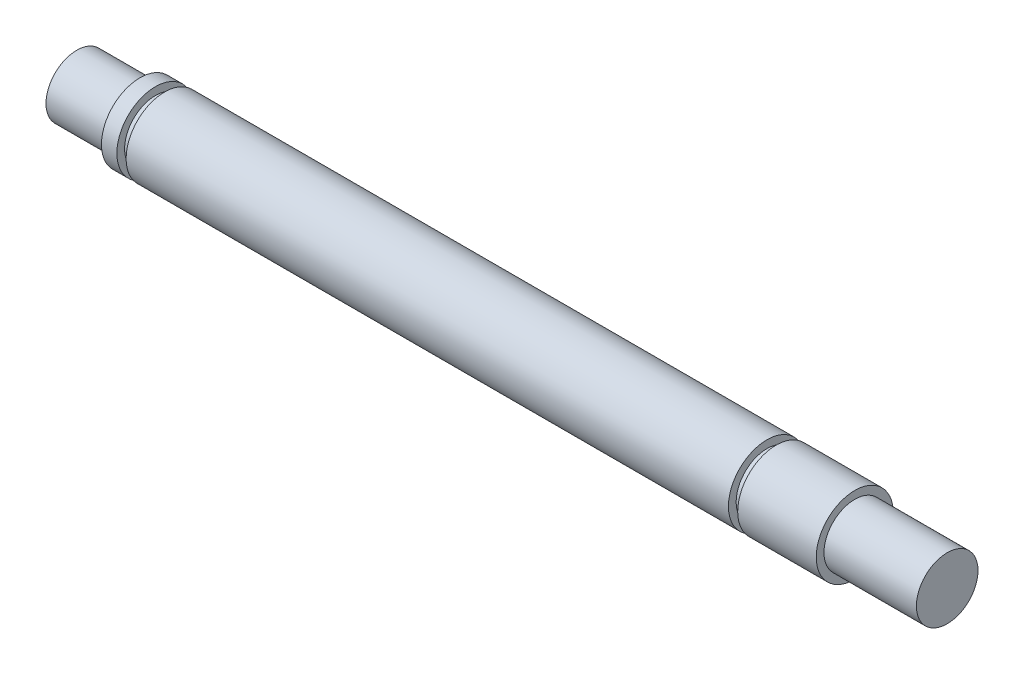
ISO-10303-21;
HEADER;
FILE_DESCRIPTION(('STEP AP214'),'2;1');
FILE_NAME('part.step','',(''),(''),'','','');
FILE_SCHEMA(('AUTOMOTIVE_DESIGN { 1 0 10303 214 1 1 1 1 }'));
ENDSEC;
DATA;
#1=APPLICATION_CONTEXT('core data for automotive mechanical design processes');
#2=APPLICATION_PROTOCOL_DEFINITION('international standard','automotive_design',2000,#1);
#3=PRODUCT_CONTEXT('',#1,'mechanical');
#4=PRODUCT('Part','Part','',(#3));
#5=PRODUCT_RELATED_PRODUCT_CATEGORY('part','',(#4));
#6=PRODUCT_DEFINITION_FORMATION('','',#4);
#7=PRODUCT_DEFINITION_CONTEXT('part definition',#1,'design');
#8=PRODUCT_DEFINITION('design','',#6,#7);
#9=PRODUCT_DEFINITION_SHAPE('','',#8);
#10=(LENGTH_UNIT() NAMED_UNIT(*) SI_UNIT(.MILLI.,.METRE.));
#11=(NAMED_UNIT(*) PLANE_ANGLE_UNIT() SI_UNIT($,.RADIAN.));
#12=(NAMED_UNIT(*) SI_UNIT($,.STERADIAN.) SOLID_ANGLE_UNIT());
#13=UNCERTAINTY_MEASURE_WITH_UNIT(LENGTH_MEASURE(1.E-05),#10,'distance_accuracy_value','');
#14=(GEOMETRIC_REPRESENTATION_CONTEXT(3) GLOBAL_UNCERTAINTY_ASSIGNED_CONTEXT((#13)) GLOBAL_UNIT_ASSIGNED_CONTEXT((#10,
#11,#12)) REPRESENTATION_CONTEXT('',''));
#15=CARTESIAN_POINT('',(0.,0.,0.));
#16=DIRECTION('',(0.,0.,1.));
#17=DIRECTION('',(1.,0.,0.));
#18=AXIS2_PLACEMENT_3D('',#15,#16,#17);
#19=CARTESIAN_POINT('',(0.,0.,0.));
#20=DIRECTION('',(-1.,0.,0.));
#21=DIRECTION('',(0.,0.,1.));
#22=AXIS2_PLACEMENT_3D('',#19,#20,#21);
#23=CYLINDRICAL_SURFACE('',#22,4.00000000000001);
#24=CARTESIAN_POINT('',(-39.2,0.,0.));
#25=DIRECTION('',(-1.,0.,0.));
#26=DIRECTION('',(0.,0.,1.));
#27=AXIS2_PLACEMENT_3D('',#24,#25,#26);
#28=CIRCLE('',#27,4.00000000000001);
#29=CARTESIAN_POINT('',(-39.2,0.,4.00000000000001));
#30=VERTEX_POINT('',#29);
#31=EDGE_CURVE('E108',#30,#30,#28,.T.);
#32=ORIENTED_EDGE('',*,*,#31,.T.);
#33=EDGE_LOOP('',(#32));
#34=FACE_BOUND('',#33,.T.);
#35=CARTESIAN_POINT('',(-40.4,0.,0.));
#36=DIRECTION('',(-1.,0.,0.));
#37=DIRECTION('',(0.,0.,1.));
#38=AXIS2_PLACEMENT_3D('',#35,#36,#37);
#39=CIRCLE('',#38,4.00000000000001);
#40=CARTESIAN_POINT('',(-40.4,0.,4.00000000000001));
#41=VERTEX_POINT('',#40);
#42=EDGE_CURVE('E71',#41,#41,#39,.T.);
#43=ORIENTED_EDGE('',*,*,#42,.F.);
#44=EDGE_LOOP('',(#43));
#45=FACE_BOUND('',#44,.T.);
#46=ADVANCED_FACE('F46',(#34,#45),#23,.T.);
#47=CARTESIAN_POINT('',(-39.2,-5.00000000000001,0.));
#48=DIRECTION('',(-1.,0.,0.));
#49=DIRECTION('',(0.,0.,1.));
#50=AXIS2_PLACEMENT_3D('',#47,#48,#49);
#51=PLANE('',#50);
#52=CARTESIAN_POINT('',(-39.2,0.,0.));
#53=DIRECTION('',(-1.,0.,0.));
#54=DIRECTION('',(0.,0.,1.));
#55=AXIS2_PLACEMENT_3D('',#52,#53,#54);
#56=CIRCLE('',#55,5.00000000000001);
#57=CARTESIAN_POINT('',(-39.2,0.,5.00000000000001));
#58=VERTEX_POINT('',#57);
#59=EDGE_CURVE('E106',#58,#58,#56,.T.);
#60=ORIENTED_EDGE('',*,*,#59,.T.);
#61=EDGE_LOOP('',(#60));
#62=FACE_BOUND('',#61,.T.);
#63=ORIENTED_EDGE('',*,*,#31,.F.);
#64=EDGE_LOOP('',(#63));
#65=FACE_BOUND('',#64,.T.);
#66=ADVANCED_FACE('F145',(#62,#65),#51,.T.);
#67=CARTESIAN_POINT('',(0.,0.,0.));
#68=DIRECTION('',(-1.,0.,0.));
#69=DIRECTION('',(0.,0.,1.));
#70=AXIS2_PLACEMENT_3D('',#67,#68,#69);
#71=CYLINDRICAL_SURFACE('',#70,5.00000000000001);
#72=CARTESIAN_POINT('',(39.,0.,0.));
#73=DIRECTION('',(-1.,0.,0.));
#74=DIRECTION('',(0.,0.,1.));
#75=AXIS2_PLACEMENT_3D('',#72,#73,#74);
#76=CIRCLE('',#75,5.);
#77=CARTESIAN_POINT('',(39.,0.,5.));
#78=VERTEX_POINT('',#77);
#79=EDGE_CURVE('E103',#78,#78,#76,.T.);
#80=ORIENTED_EDGE('',*,*,#79,.T.);
#81=EDGE_LOOP('',(#80));
#82=FACE_BOUND('',#81,.T.);
#83=ORIENTED_EDGE('',*,*,#59,.F.);
#84=EDGE_LOOP('',(#83));
#85=FACE_BOUND('',#84,.T.);
#86=ADVANCED_FACE('F139',(#82,#85),#71,.T.);
#87=CARTESIAN_POINT('',(39.,-5.,0.));
#88=DIRECTION('',(1.,0.,0.));
#89=DIRECTION('',(0.,0.,-1.));
#90=AXIS2_PLACEMENT_3D('',#87,#88,#89);
#91=PLANE('',#90);
#92=CARTESIAN_POINT('',(39.,0.,0.));
#93=DIRECTION('',(-1.,0.,0.));
#94=DIRECTION('',(0.,0.,1.));
#95=AXIS2_PLACEMENT_3D('',#92,#93,#94);
#96=CIRCLE('',#95,4.);
#97=CARTESIAN_POINT('',(39.,0.,4.));
#98=VERTEX_POINT('',#97);
#99=EDGE_CURVE('E100',#98,#98,#96,.T.);
#100=ORIENTED_EDGE('',*,*,#99,.T.);
#101=EDGE_LOOP('',(#100));
#102=FACE_BOUND('',#101,.T.);
#103=ORIENTED_EDGE('',*,*,#79,.F.);
#104=EDGE_LOOP('',(#103));
#105=FACE_BOUND('',#104,.T.);
#106=ADVANCED_FACE('F133',(#102,#105),#91,.T.);
#107=CARTESIAN_POINT('',(0.,0.,0.));
#108=DIRECTION('',(-1.,0.,0.));
#109=DIRECTION('',(0.,0.,1.));
#110=AXIS2_PLACEMENT_3D('',#107,#108,#109);
#111=CYLINDRICAL_SURFACE('',#110,4.);
#112=CARTESIAN_POINT('',(40.2,0.,0.));
#113=DIRECTION('',(-1.,0.,0.));
#114=DIRECTION('',(0.,0.,1.));
#115=AXIS2_PLACEMENT_3D('',#112,#113,#114);
#116=CIRCLE('',#115,4.);
#117=CARTESIAN_POINT('',(40.2,0.,4.));
#118=VERTEX_POINT('',#117);
#119=EDGE_CURVE('E97',#118,#118,#116,.T.);
#120=ORIENTED_EDGE('',*,*,#119,.T.);
#121=EDGE_LOOP('',(#120));
#122=FACE_BOUND('',#121,.T.);
#123=ORIENTED_EDGE('',*,*,#99,.F.);
#124=EDGE_LOOP('',(#123));
#125=FACE_BOUND('',#124,.T.);
#126=ADVANCED_FACE('F127',(#122,#125),#111,.T.);
#127=CARTESIAN_POINT('',(40.2,-4.,0.));
#128=DIRECTION('',(-1.,0.,0.));
#129=DIRECTION('',(0.,0.,1.));
#130=AXIS2_PLACEMENT_3D('',#127,#128,#129);
#131=PLANE('',#130);
#132=CARTESIAN_POINT('',(40.2,0.,0.));
#133=DIRECTION('',(-1.,0.,0.));
#134=DIRECTION('',(0.,0.,1.));
#135=AXIS2_PLACEMENT_3D('',#132,#133,#134);
#136=CIRCLE('',#135,5.00000000000001);
#137=CARTESIAN_POINT('',(40.2,0.,5.00000000000001));
#138=VERTEX_POINT('',#137);
#139=EDGE_CURVE('E94',#138,#138,#136,.T.);
#140=ORIENTED_EDGE('',*,*,#139,.T.);
#141=EDGE_LOOP('',(#140));
#142=FACE_BOUND('',#141,.T.);
#143=ORIENTED_EDGE('',*,*,#119,.F.);
#144=EDGE_LOOP('',(#143));
#145=FACE_BOUND('',#144,.T.);
#146=ADVANCED_FACE('F120',(#142,#145),#131,.T.);
#147=CARTESIAN_POINT('',(0.,0.,0.));
#148=DIRECTION('',(-1.,0.,0.));
#149=DIRECTION('',(0.,0.,1.));
#150=AXIS2_PLACEMENT_3D('',#147,#148,#149);
#151=CYLINDRICAL_SURFACE('',#150,5.00000000000001);
#152=CARTESIAN_POINT('',(44.4,-4.46514277487296,-2.24999999999999));
#153=CARTESIAN_POINT('',(44.5189612127309,-4.46515039872744,-2.24999304031582));
#154=CARTESIAN_POINT('',(44.6381147802611,-4.46996667268982,-2.24050444334662));
#155=CARTESIAN_POINT('',(44.8728981715027,-4.48857891323594,-2.2029695202572));
#156=CARTESIAN_POINT('',(44.9885184448773,-4.50239729083486,-2.17487687588998));
#157=CARTESIAN_POINT('',(45.2124159714558,-4.53710585458754,-2.10149811494295));
#158=CARTESIAN_POINT('',(45.320723962715,-4.55796389692777,-2.05629003690715));
#159=CARTESIAN_POINT('',(45.528190754982,-4.60435303457612,-1.95019826041787));
#160=CARTESIAN_POINT('',(45.6273506694295,-4.62988356005073,-1.8893164730866));
#161=CARTESIAN_POINT('',(45.8209847689927,-4.68481687387392,-1.7488668244811));
#162=CARTESIAN_POINT('',(45.9147149367887,-4.71436409953235,-1.66832919766813));
#163=CARTESIAN_POINT('',(46.0878990763539,-4.77282391954205,-1.49288314705884));
#164=CARTESIAN_POINT('',(46.1673469833383,-4.80173623973546,-1.39796864967688));
#165=CARTESIAN_POINT('',(46.3137357994462,-4.85747480215183,-1.1904034023811));
#166=CARTESIAN_POINT('',(46.3798097543149,-4.88411395697376,-1.07708634932838));
#167=CARTESIAN_POINT('',(46.4916269809751,-4.93049745168419,-0.83952600977261));
#168=CARTESIAN_POINT('',(46.5373807075165,-4.95024533600558,-0.715288381409372));
#169=CARTESIAN_POINT('',(46.6044687281946,-4.9795911682076,-0.467253632116468));
#170=CARTESIAN_POINT('',(46.6270941945019,-4.98972320525302,-0.343870281116719));
#171=CARTESIAN_POINT('',(46.6514860613445,-5.00065622282592,-0.0946715176300331));
#172=CARTESIAN_POINT('',(46.6532624388918,-5.00146166644927,0.031142702727144));
#173=CARTESIAN_POINT('',(46.6365153850402,-4.99394241822248,0.272124930597739));
#174=CARTESIAN_POINT('',(46.6194197052671,-4.98625984599744,0.387416232492518));
#175=CARTESIAN_POINT('',(46.5679018148151,-4.96354367577185,0.613288459239055));
#176=CARTESIAN_POINT('',(46.5334783200384,-4.94850953297702,0.723869034338142));
#177=CARTESIAN_POINT('',(46.4479219494241,-4.91222614034772,0.939228995401035));
#178=CARTESIAN_POINT('',(46.3965432134654,-4.89088595660151,1.04389475376014));
#179=CARTESIAN_POINT('',(46.2788037048718,-4.84401587857546,1.24339321925694));
#180=CARTESIAN_POINT('',(46.2124374542342,-4.81848445331245,1.3382223125092));
#181=CARTESIAN_POINT('',(46.0604441642796,-4.76331481407977,1.52345175293301));
#182=CARTESIAN_POINT('',(45.97369917665,-4.73351145466939,1.61288673432272));
#183=CARTESIAN_POINT('',(45.7864926994671,-4.67460929075159,1.77639992608745));
#184=CARTESIAN_POINT('',(45.6860240917898,-4.64551086115732,1.85047011655516));
#185=CARTESIAN_POINT('',(45.4687643244717,-4.5900189182413,1.98423981017749));
#186=CARTESIAN_POINT('',(45.351452562996,-4.56379860249301,2.04317215242965));
#187=CARTESIAN_POINT('',(45.1070859529058,-4.51919374197598,2.14003834281188));
#188=CARTESIAN_POINT('',(44.980039499531,-4.50080253313334,2.17799005773756));
#189=CARTESIAN_POINT('',(44.7295062611783,-4.47567706017383,2.22914248632388));
#190=CARTESIAN_POINT('',(44.6064186193687,-4.46820077828808,2.24392437246758));
#191=CARTESIAN_POINT('',(44.3593206899302,-4.46362263539944,2.25302242470033));
#192=CARTESIAN_POINT('',(44.2353108473139,-4.46651605832119,2.24734789422978));
#193=CARTESIAN_POINT('',(44.0003998351236,-4.48157509018499,2.21714216163568));
#194=CARTESIAN_POINT('',(43.8892441902212,-4.49297960430388,2.1941574385562));
#195=CARTESIAN_POINT('',(43.6725003454044,-4.52274424903305,2.13212542419365));
#196=CARTESIAN_POINT('',(43.5669136096629,-4.5411061986031,2.09307393216705));
#197=CARTESIAN_POINT('',(43.3589518292208,-4.58371481317645,1.99809284583428));
#198=CARTESIAN_POINT('',(43.2569366350542,-4.60818960972129,1.94148122987604));
#199=CARTESIAN_POINT('',(43.0633163861791,-4.6599895568098,1.81362927889094));
#200=CARTESIAN_POINT('',(42.9717163291005,-4.68731606376626,1.74238196666508));
#201=CARTESIAN_POINT('',(42.7921744620641,-4.74496334454856,1.57908877421522));
#202=CARTESIAN_POINT('',(42.705468104843,-4.77531541652936,1.48568977503586));
#203=CARTESIAN_POINT('',(42.548673456089,-4.83317624810731,1.28502997436723));
#204=CARTESIAN_POINT('',(42.4785877777098,-4.86068456021688,1.1777669972316));
#205=CARTESIAN_POINT('',(42.3566038585041,-4.91017542897078,0.950682209086035));
#206=CARTESIAN_POINT('',(42.3048937176252,-4.93210022008003,0.830745952505885));
#207=CARTESIAN_POINT('',(42.2228237511215,-4.96751583574375,0.58261953939122));
#208=CARTESIAN_POINT('',(42.1924488729429,-4.9810126057273,0.454435271872208));
#209=CARTESIAN_POINT('',(42.1560289584297,-4.9972661349817,0.204394813787118));
#210=CARTESIAN_POINT('',(42.1482501650668,-5.00078768109047,0.0828396086643544));
#211=CARTESIAN_POINT('',(42.1524088088586,-4.99891579804309,-0.159848279708588));
#212=CARTESIAN_POINT('',(42.1643416758091,-4.9935244353698,-0.280981054375453));
#213=CARTESIAN_POINT('',(42.2063523683349,-4.9748630703112,-0.51354948845287));
#214=CARTESIAN_POINT('',(42.2355644965561,-4.96196940870593,-0.625174452755551));
#215=CARTESIAN_POINT('',(42.310278337663,-4.92983796875449,-0.841845251095445));
#216=CARTESIAN_POINT('',(42.3557828565987,-4.91059909761341,-0.946889948144515));
#217=CARTESIAN_POINT('',(42.4640748909494,-4.86649288960107,-1.1527517065352));
#218=CARTESIAN_POINT('',(42.5275585236712,-4.8414081228174,-1.25315478757822));
#219=CARTESIAN_POINT('',(42.6690554185829,-4.78846161065105,-1.4423245633934));
#220=CARTESIAN_POINT('',(42.7470749449179,-4.7605986704487,-1.53108621316286));
#221=CARTESIAN_POINT('',(42.922836352474,-4.7023509480799,-1.70196716671107));
#222=CARTESIAN_POINT('',(43.0216633278591,-4.67194455656387,-1.78296764783156));
#223=CARTESIAN_POINT('',(43.2322647993636,-4.61420006725823,-1.92749297632141));
#224=CARTESIAN_POINT('',(43.3440475537767,-4.58686394862664,-1.99100658915978));
#225=CARTESIAN_POINT('',(43.5788484638152,-4.53856864513169,-2.09879543180336));
#226=CARTESIAN_POINT('',(43.70193050949,-4.51764904631088,-2.1429519296523));
#227=CARTESIAN_POINT('',(43.8914549837553,-4.49356898894666,-2.19275164773713));
#228=CARTESIAN_POINT('',(43.9553848902609,-4.4867618135128,-2.20660710269013));
#229=CARTESIAN_POINT('',(44.0844163971542,-4.47582163437336,-2.2287167788832));
#230=CARTESIAN_POINT('',(44.1495170858458,-4.47168663524701,-2.23697517989219));
#231=CARTESIAN_POINT('',(44.2456576646017,-4.46770340658948,-2.24491269447909));
#232=CARTESIAN_POINT('',(44.2764859113699,-4.46674464896163,-2.24681915664302));
#233=CARTESIAN_POINT('',(44.3382051103306,-4.46546333269433,-2.24936373361877));
#234=CARTESIAN_POINT('',(44.3690960644906,-4.46514079433576,-2.25000180799795));
#235=CARTESIAN_POINT('',(44.4,-4.46514277487296,-2.24999999999999));
#236=B_SPLINE_CURVE_WITH_KNOTS('',3,(#152,#153,#154,#155,#156,#157,#158,#159,#160,#161,#162,
#163,#164,#165,#166,#167,#168,#169,#170,#171,#172,#173,#174,#175,#176,#177,#178,#179,#180,#181,
#182,#183,#184,#185,#186,#187,#188,#189,#190,#191,#192,#193,#194,#195,#196,#197,#198,#199,#200,
#201,#202,#203,#204,#205,#206,#207,#208,#209,#210,#211,#212,#213,#214,#215,#216,#217,#218,#219,
#220,#221,#222,#223,#224,#225,#226,#227,#228,#229,#230,#231,#232,#233,#234,#235),.UNSPECIFIED.,
.T.,.F.,(4,2,2,2,2,2,2,2,2,2,2,2,2,2,2,2,2,2,2,2,2,2,2,2,2,2,2,2,2,2,2,2,2,2,2,2,2,2,2,2,2,4),
(0.,0.356759742987548,0.714411062073144,1.07045091984823,1.4264473856185,1.80599601944597,
2.18570544513355,2.58519198578236,2.98447275197117,3.35999219707462,3.73533193577183,
4.08410830185012,4.43291051821012,4.78701075889255,5.1412406348555,5.52388400014612,
5.90672659268632,6.30625734447512,6.705447335537,7.07598167335176,7.44634751591085,
7.78705357899944,8.12784877819467,8.48402022975501,8.84036187276858,9.23157909435325,
9.62285778358302,10.0180336177097,10.4129303647319,10.7766046049826,11.1401945381678,
11.4869501554105,11.83376552337,12.1964652511595,12.5593216450042,12.9515422543471,
13.3440142630043,13.738861021211,13.9359176589375,14.1328269760451,14.2255036426529,
14.318183263485),.UNSPECIFIED.);
#237=CARTESIAN_POINT('',(44.4,-4.46514277487296,-2.24999999999999));
#238=VERTEX_POINT('',#237);
#239=EDGE_CURVE('E49',#238,#238,#236,.T.);
#240=ORIENTED_EDGE('',*,*,#239,.F.);
#241=EDGE_LOOP('',(#240));
#242=FACE_BOUND('',#241,.T.);
#243=CARTESIAN_POINT('',(50.4,0.,0.));
#244=DIRECTION('',(-1.,0.,0.));
#245=DIRECTION('',(0.,0.,1.));
#246=AXIS2_PLACEMENT_3D('',#243,#244,#245);
#247=CIRCLE('',#246,5.00000000000001);
#248=CARTESIAN_POINT('',(50.4,0.,5.00000000000001));
#249=VERTEX_POINT('',#248);
#250=EDGE_CURVE('E91',#249,#249,#247,.T.);
#251=ORIENTED_EDGE('',*,*,#250,.T.);
#252=EDGE_LOOP('',(#251));
#253=FACE_BOUND('',#252,.T.);
#254=ORIENTED_EDGE('',*,*,#139,.F.);
#255=EDGE_LOOP('',(#254));
#256=FACE_BOUND('',#255,.T.);
#257=ADVANCED_FACE('F116',(#242,#253,#256),#151,.T.);
#258=CARTESIAN_POINT('',(50.4,-5.00000000000001,0.));
#259=DIRECTION('',(1.,0.,0.));
#260=DIRECTION('',(0.,0.,-1.));
#261=AXIS2_PLACEMENT_3D('',#258,#259,#260);
#262=PLANE('',#261);
#263=CARTESIAN_POINT('',(50.4,0.,0.));
#264=DIRECTION('',(1.,0.,0.));
#265=DIRECTION('',(0.,0.,-1.));
#266=AXIS2_PLACEMENT_3D('',#263,#264,#265);
#267=CIRCLE('',#266,4.);
#268=CARTESIAN_POINT('',(50.4,0.,-4.));
#269=VERTEX_POINT('',#268);
#270=EDGE_CURVE('E13',#269,#269,#267,.T.);
#271=ORIENTED_EDGE('',*,*,#270,.F.);
#272=EDGE_LOOP('',(#271));
#273=FACE_BOUND('',#272,.T.);
#274=ORIENTED_EDGE('',*,*,#250,.F.);
#275=EDGE_LOOP('',(#274));
#276=FACE_BOUND('',#275,.T.);
#277=ADVANCED_FACE('F119',(#273,#276),#262,.T.);
#278=CARTESIAN_POINT('',(-50.6,-4.00000000000001,0.));
#279=DIRECTION('',(-1.,0.,0.));
#280=DIRECTION('',(0.,0.,1.));
#281=AXIS2_PLACEMENT_3D('',#278,#279,#280);
#282=PLANE('',#281);
#283=CARTESIAN_POINT('',(-50.6,0.,0.));
#284=DIRECTION('',(-1.,0.,0.));
#285=DIRECTION('',(0.,0.,1.));
#286=AXIS2_PLACEMENT_3D('',#283,#284,#285);
#287=CIRCLE('',#286,4.00000000000001);
#288=CARTESIAN_POINT('',(-50.6,0.,4.00000000000001));
#289=VERTEX_POINT('',#288);
#290=EDGE_CURVE('E88',#289,#289,#287,.T.);
#291=ORIENTED_EDGE('',*,*,#290,.T.);
#292=EDGE_LOOP('',(#291));
#293=FACE_BOUND('',#292,.T.);
#294=ADVANCED_FACE('F158',(#293),#282,.T.);
#295=CARTESIAN_POINT('',(0.,0.,0.));
#296=DIRECTION('',(-1.,0.,0.));
#297=DIRECTION('',(0.,0.,1.));
#298=AXIS2_PLACEMENT_3D('',#295,#296,#297);
#299=CYLINDRICAL_SURFACE('',#298,4.00000000000001);
#300=CARTESIAN_POINT('',(-42.4,0.,0.));
#301=DIRECTION('',(-1.,0.,0.));
#302=DIRECTION('',(0.,0.,1.));
#303=AXIS2_PLACEMENT_3D('',#300,#301,#302);
#304=CIRCLE('',#303,4.00000000000001);
#305=CARTESIAN_POINT('',(-42.4,0.,4.00000000000001));
#306=VERTEX_POINT('',#305);
#307=EDGE_CURVE('E85',#306,#306,#304,.T.);
#308=ORIENTED_EDGE('',*,*,#307,.T.);
#309=EDGE_LOOP('',(#308));
#310=FACE_BOUND('',#309,.T.);
#311=ORIENTED_EDGE('',*,*,#290,.F.);
#312=EDGE_LOOP('',(#311));
#313=FACE_BOUND('',#312,.T.);
#314=ADVANCED_FACE('F162',(#310,#313),#299,.T.);
#315=CARTESIAN_POINT('',(-42.4,-5.00000000000001,0.));
#316=DIRECTION('',(-1.,0.,0.));
#317=DIRECTION('',(0.,0.,1.));
#318=AXIS2_PLACEMENT_3D('',#315,#316,#317);
#319=PLANE('',#318);
#320=CARTESIAN_POINT('',(-42.4,0.,0.));
#321=DIRECTION('',(-1.,0.,0.));
#322=DIRECTION('',(0.,0.,1.));
#323=AXIS2_PLACEMENT_3D('',#320,#321,#322);
#324=CIRCLE('',#323,5.00000000000001);
#325=CARTESIAN_POINT('',(-42.4,0.,5.00000000000001));
#326=VERTEX_POINT('',#325);
#327=EDGE_CURVE('E82',#326,#326,#324,.T.);
#328=ORIENTED_EDGE('',*,*,#327,.T.);
#329=EDGE_LOOP('',(#328));
#330=FACE_BOUND('',#329,.T.);
#331=ORIENTED_EDGE('',*,*,#307,.F.);
#332=EDGE_LOOP('',(#331));
#333=FACE_BOUND('',#332,.T.);
#334=ADVANCED_FACE('F166',(#330,#333),#319,.T.);
#335=CARTESIAN_POINT('',(0.,0.,0.));
#336=DIRECTION('',(-1.,0.,0.));
#337=DIRECTION('',(0.,0.,1.));
#338=AXIS2_PLACEMENT_3D('',#335,#336,#337);
#339=CYLINDRICAL_SURFACE('',#338,5.00000000000001);
#340=CARTESIAN_POINT('',(-40.4,0.,0.));
#341=DIRECTION('',(-1.,0.,0.));
#342=DIRECTION('',(0.,0.,1.));
#343=AXIS2_PLACEMENT_3D('',#340,#341,#342);
#344=CIRCLE('',#343,5.00000000000001);
#345=CARTESIAN_POINT('',(-40.4,0.,5.00000000000001));
#346=VERTEX_POINT('',#345);
#347=EDGE_CURVE('E75',#346,#346,#344,.T.);
#348=ORIENTED_EDGE('',*,*,#347,.T.);
#349=EDGE_LOOP('',(#348));
#350=FACE_BOUND('',#349,.T.);
#351=ORIENTED_EDGE('',*,*,#327,.F.);
#352=EDGE_LOOP('',(#351));
#353=FACE_BOUND('',#352,.T.);
#354=ADVANCED_FACE('F170',(#350,#353),#339,.T.);
#355=CARTESIAN_POINT('',(-40.4,-4.00000000000001,0.));
#356=DIRECTION('',(1.,0.,0.));
#357=DIRECTION('',(0.,0.,-1.));
#358=AXIS2_PLACEMENT_3D('',#355,#356,#357);
#359=PLANE('',#358);
#360=ORIENTED_EDGE('',*,*,#42,.T.);
#361=EDGE_LOOP('',(#360));
#362=FACE_BOUND('',#361,.T.);
#363=ORIENTED_EDGE('',*,*,#347,.F.);
#364=EDGE_LOOP('',(#363));
#365=FACE_BOUND('',#364,.T.);
#366=ADVANCED_FACE('F65',(#362,#365),#359,.T.);
#367=CARTESIAN_POINT('',(44.4,0.0999999999999812,0.));
#368=DIRECTION('',(0.,-1.,0.));
#369=DIRECTION('',(0.,0.,-1.));
#370=AXIS2_PLACEMENT_3D('',#367,#368,#369);
#371=CONICAL_SURFACE('',#370,2.24999999999999,1.02974425867665);
#372=CARTESIAN_POINT('',(44.4,1.451936392812,0.));
#373=VERTEX_POINT('',#372);
#374=VERTEX_LOOP('',#373);
#375=FACE_BOUND('',#374,.T.);
#376=CARTESIAN_POINT('',(44.4,0.0999999999999812,0.));
#377=DIRECTION('',(0.,-1.,0.));
#378=DIRECTION('',(0.,0.,-1.));
#379=AXIS2_PLACEMENT_3D('',#376,#377,#378);
#380=CIRCLE('',#379,2.24999999999999);
#381=CARTESIAN_POINT('',(44.4,0.0999999999999812,-2.24999999999999));
#382=VERTEX_POINT('',#381);
#383=EDGE_CURVE('E69',#382,#382,#380,.T.);
#384=ORIENTED_EDGE('',*,*,#383,.T.);
#385=EDGE_LOOP('',(#384));
#386=FACE_BOUND('',#385,.T.);
#387=ADVANCED_FACE('F61',(#375,#386),#371,.F.);
#388=CARTESIAN_POINT('',(44.4,-5.00000000000001,0.));
#389=DIRECTION('',(0.,-1.,0.));
#390=DIRECTION('',(0.,0.,-1.));
#391=AXIS2_PLACEMENT_3D('',#388,#389,#390);
#392=CYLINDRICAL_SURFACE('',#391,2.24999999999999);
#393=ORIENTED_EDGE('',*,*,#239,.T.);
#394=EDGE_LOOP('',(#393));
#395=FACE_BOUND('',#394,.T.);
#396=ORIENTED_EDGE('',*,*,#383,.F.);
#397=EDGE_LOOP('',(#396));
#398=FACE_BOUND('',#397,.T.);
#399=ADVANCED_FACE('F64',(#395,#398),#392,.F.);
#400=CARTESIAN_POINT('',(62.4,0.,0.));
#401=DIRECTION('',(-1.,0.,0.));
#402=DIRECTION('',(0.,0.,1.));
#403=AXIS2_PLACEMENT_3D('',#400,#401,#402);
#404=CYLINDRICAL_SURFACE('',#403,4.);
#405=CARTESIAN_POINT('',(62.4,0.,0.));
#406=DIRECTION('',(1.,0.,0.));
#407=DIRECTION('',(0.,0.,-1.));
#408=AXIS2_PLACEMENT_3D('',#405,#406,#407);
#409=CIRCLE('',#408,4.);
#410=CARTESIAN_POINT('',(62.4,0.,-4.));
#411=VERTEX_POINT('',#410);
#412=EDGE_CURVE('E72',#411,#411,#409,.T.);
#413=ORIENTED_EDGE('',*,*,#412,.F.);
#414=EDGE_LOOP('',(#413));
#415=FACE_BOUND('',#414,.T.);
#416=ORIENTED_EDGE('',*,*,#270,.T.);
#417=EDGE_LOOP('',(#416));
#418=FACE_BOUND('',#417,.T.);
#419=ADVANCED_FACE('F180',(#415,#418),#404,.T.);
#420=CARTESIAN_POINT('',(62.4,0.,0.));
#421=DIRECTION('',(1.,0.,0.));
#422=DIRECTION('',(0.,0.,-1.));
#423=AXIS2_PLACEMENT_3D('',#420,#421,#422);
#424=PLANE('',#423);
#425=ORIENTED_EDGE('',*,*,#412,.T.);
#426=EDGE_LOOP('',(#425));
#427=FACE_BOUND('',#426,.T.);
#428=ADVANCED_FACE('F183',(#427),#424,.T.);
#429=CLOSED_SHELL('',(#46,#66,#86,#106,#126,#146,#257,#277,#294,#314,#334,#354,#366,#387,#399,
#419,#428));
#430=MANIFOLD_SOLID_BREP('B2',#429);
#431=ADVANCED_BREP_SHAPE_REPRESENTATION('',(#18,#430),#14);
#432=SHAPE_DEFINITION_REPRESENTATION(#9,#431);
ENDSEC;
END-ISO-10303-21;
